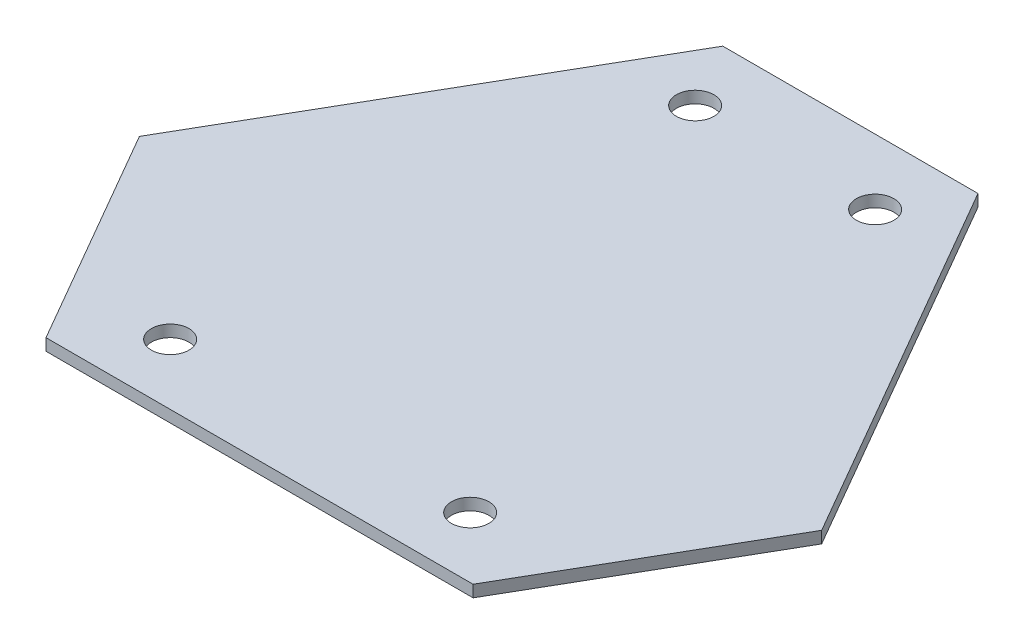
ISO-10303-21;
HEADER;
FILE_DESCRIPTION(('STEP AP214'),'2;1');
FILE_NAME('part.step','',(''),(''),'','','');
FILE_SCHEMA(('AUTOMOTIVE_DESIGN { 1 0 10303 214 1 1 1 1 }'));
ENDSEC;
DATA;
#1=APPLICATION_CONTEXT('core data for automotive mechanical design processes');
#2=APPLICATION_PROTOCOL_DEFINITION('international standard','automotive_design',2000,#1);
#3=PRODUCT_CONTEXT('',#1,'mechanical');
#4=PRODUCT('Part','Part','',(#3));
#5=PRODUCT_RELATED_PRODUCT_CATEGORY('part','',(#4));
#6=PRODUCT_DEFINITION_FORMATION('','',#4);
#7=PRODUCT_DEFINITION_CONTEXT('part definition',#1,'design');
#8=PRODUCT_DEFINITION('design','',#6,#7);
#9=PRODUCT_DEFINITION_SHAPE('','',#8);
#10=(LENGTH_UNIT() NAMED_UNIT(*) SI_UNIT(.MILLI.,.METRE.));
#11=(NAMED_UNIT(*) PLANE_ANGLE_UNIT() SI_UNIT($,.RADIAN.));
#12=(NAMED_UNIT(*) SI_UNIT($,.STERADIAN.) SOLID_ANGLE_UNIT());
#13=UNCERTAINTY_MEASURE_WITH_UNIT(LENGTH_MEASURE(1.E-05),#10,'distance_accuracy_value','');
#14=(GEOMETRIC_REPRESENTATION_CONTEXT(3) GLOBAL_UNCERTAINTY_ASSIGNED_CONTEXT((#13)) GLOBAL_UNIT_ASSIGNED_CONTEXT((#10,
#11,#12)) REPRESENTATION_CONTEXT('',''));
#15=CARTESIAN_POINT('',(0.,0.,0.));
#16=DIRECTION('',(0.,0.,1.));
#17=DIRECTION('',(1.,0.,0.));
#18=AXIS2_PLACEMENT_3D('',#15,#16,#17);
#19=CARTESIAN_POINT('',(0.,0.,0.));
#20=DIRECTION('',(0.,1.,0.));
#21=DIRECTION('',(0.,0.,1.));
#22=AXIS2_PLACEMENT_3D('',#19,#20,#21);
#23=PLANE('',#22);
#24=DIRECTION('',(0.500000000000002,0.,0.866025403784437));
#25=VECTOR('',#24,1.);
#26=CARTESIAN_POINT('',(15.875,0.,-9.16543552338539));
#27=LINE('',#26,#25);
#28=CARTESIAN_POINT('',(8.64301556751302,0.,-21.6916));
#29=VERTEX_POINT('',#28);
#30=CARTESIAN_POINT('',(23.1069844324869,0.,3.36072895322899));
#31=VERTEX_POINT('',#30);
#32=EDGE_CURVE('E163',#29,#31,#27,.T.);
#33=ORIENTED_EDGE('',*,*,#32,.T.);
#34=DIRECTION('',(-0.5,0.,0.866025403784439));
#35=VECTOR('',#34,1.);
#36=CARTESIAN_POINT('',(18.7854766487303,0.,10.8457999999999));
#37=LINE('',#36,#35);
#38=CARTESIAN_POINT('',(14.4639688649739,0.,18.3308710467703));
#39=VERTEX_POINT('',#38);
#40=EDGE_CURVE('E161',#31,#39,#37,.T.);
#41=ORIENTED_EDGE('',*,*,#40,.T.);
#42=DIRECTION('',(-1.,0.,0.));
#43=VECTOR('',#42,1.);
#44=CARTESIAN_POINT('',(0.,0.,18.3308710467703));
#45=LINE('',#44,#43);
#46=CARTESIAN_POINT('',(-14.4639688649738,0.,18.3308710467704));
#47=VERTEX_POINT('',#46);
#48=EDGE_CURVE('E99',#39,#47,#45,.T.);
#49=ORIENTED_EDGE('',*,*,#48,.T.);
#50=DIRECTION('',(-0.499999999999995,0.,-0.866025403784442));
#51=VECTOR('',#50,1.);
#52=CARTESIAN_POINT('',(-18.7854766487302,0.,10.8457999999997));
#53=LINE('',#52,#51);
#54=CARTESIAN_POINT('',(-23.1069844324867,0.,3.36072895322896));
#55=VERTEX_POINT('',#54);
#56=EDGE_CURVE('E169',#47,#55,#53,.T.);
#57=ORIENTED_EDGE('',*,*,#56,.T.);
#58=DIRECTION('',(0.499999999999998,0.,-0.86602540378444));
#59=VECTOR('',#58,1.);
#60=CARTESIAN_POINT('',(-15.875,0.,-9.16543552338526));
#61=LINE('',#60,#59);
#62=CARTESIAN_POINT('',(-8.64301556751303,0.,-21.6916));
#63=VERTEX_POINT('',#62);
#64=EDGE_CURVE('E125',#55,#63,#61,.T.);
#65=ORIENTED_EDGE('',*,*,#64,.T.);
#66=DIRECTION('',(1.,0.,0.));
#67=VECTOR('',#66,1.);
#68=CARTESIAN_POINT('',(0.,0.,-21.6916));
#69=LINE('',#68,#67);
#70=EDGE_CURVE('E165',#63,#29,#69,.T.);
#71=ORIENTED_EDGE('',*,*,#70,.T.);
#72=EDGE_LOOP('',(#33,#41,#49,#57,#65,#71));
#73=FACE_BOUND('',#72,.T.);
#74=CARTESIAN_POINT('',(6.096,0.,-17.272));
#75=DIRECTION('',(0.,1.,0.));
#76=DIRECTION('',(0.,0.,1.));
#77=AXIS2_PLACEMENT_3D('',#74,#75,#76);
#78=CIRCLE('',#77,1.27);
#79=CARTESIAN_POINT('',(6.096,0.,-16.002));
#80=VERTEX_POINT('',#79);
#81=EDGE_CURVE('E181',#80,#80,#78,.F.);
#82=ORIENTED_EDGE('',*,*,#81,.F.);
#83=EDGE_LOOP('',(#82));
#84=FACE_BOUND('',#83,.T.);
#85=CARTESIAN_POINT('',(-6.096,0.,-17.272));
#86=DIRECTION('',(0.,1.,0.));
#87=DIRECTION('',(0.,0.,1.));
#88=AXIS2_PLACEMENT_3D('',#85,#86,#87);
#89=CIRCLE('',#88,1.27);
#90=CARTESIAN_POINT('',(-6.096,0.,-16.002));
#91=VERTEX_POINT('',#90);
#92=EDGE_CURVE('E178',#91,#91,#89,.T.);
#93=ORIENTED_EDGE('',*,*,#92,.T.);
#94=EDGE_LOOP('',(#93));
#95=FACE_BOUND('',#94,.T.);
#96=CARTESIAN_POINT('',(-10.16,0.,14.224));
#97=DIRECTION('',(0.,1.,0.));
#98=DIRECTION('',(0.,0.,1.));
#99=AXIS2_PLACEMENT_3D('',#96,#97,#98);
#100=CIRCLE('',#99,1.27);
#101=CARTESIAN_POINT('',(-10.16,0.,15.494));
#102=VERTEX_POINT('',#101);
#103=EDGE_CURVE('E172',#102,#102,#100,.T.);
#104=ORIENTED_EDGE('',*,*,#103,.T.);
#105=EDGE_LOOP('',(#104));
#106=FACE_BOUND('',#105,.T.);
#107=CARTESIAN_POINT('',(10.16,0.,14.224));
#108=DIRECTION('',(0.,1.,0.));
#109=DIRECTION('',(0.,0.,1.));
#110=AXIS2_PLACEMENT_3D('',#107,#108,#109);
#111=CIRCLE('',#110,1.27);
#112=CARTESIAN_POINT('',(10.16,0.,15.494));
#113=VERTEX_POINT('',#112);
#114=EDGE_CURVE('E175',#113,#113,#111,.F.);
#115=ORIENTED_EDGE('',*,*,#114,.F.);
#116=EDGE_LOOP('',(#115));
#117=FACE_BOUND('',#116,.T.);
#118=ADVANCED_FACE('F60',(#73,#84,#95,#106,#117),#23,.F.);
#119=CARTESIAN_POINT('',(0.,0.8,0.));
#120=DIRECTION('',(0.,1.,0.));
#121=DIRECTION('',(0.,0.,1.));
#122=AXIS2_PLACEMENT_3D('',#119,#120,#121);
#123=PLANE('',#122);
#124=DIRECTION('',(-0.499999999999995,0.,-0.866025403784442));
#125=VECTOR('',#124,1.);
#126=CARTESIAN_POINT('',(-18.7854766487302,0.8,10.8457999999997));
#127=LINE('',#126,#125);
#128=CARTESIAN_POINT('',(-14.4639688649738,0.8,18.3308710467704));
#129=VERTEX_POINT('',#128);
#130=CARTESIAN_POINT('',(-23.1069844324867,0.8,3.36072895322896));
#131=VERTEX_POINT('',#130);
#132=EDGE_CURVE('E138',#129,#131,#127,.T.);
#133=ORIENTED_EDGE('',*,*,#132,.F.);
#134=DIRECTION('',(-1.,0.,0.));
#135=VECTOR('',#134,1.);
#136=CARTESIAN_POINT('',(0.,0.8,18.3308710467703));
#137=LINE('',#136,#135);
#138=CARTESIAN_POINT('',(14.4639688649739,0.8,18.3308710467703));
#139=VERTEX_POINT('',#138);
#140=EDGE_CURVE('E144',#139,#129,#137,.T.);
#141=ORIENTED_EDGE('',*,*,#140,.F.);
#142=DIRECTION('',(-0.5,0.,0.866025403784439));
#143=VECTOR('',#142,1.);
#144=CARTESIAN_POINT('',(18.7854766487303,0.8,10.8457999999999));
#145=LINE('',#144,#143);
#146=CARTESIAN_POINT('',(23.1069844324869,0.8,3.36072895322899));
#147=VERTEX_POINT('',#146);
#148=EDGE_CURVE('E184',#147,#139,#145,.T.);
#149=ORIENTED_EDGE('',*,*,#148,.F.);
#150=DIRECTION('',(0.500000000000002,0.,0.866025403784437));
#151=VECTOR('',#150,1.);
#152=CARTESIAN_POINT('',(15.875,0.8,-9.16543552338539));
#153=LINE('',#152,#151);
#154=CARTESIAN_POINT('',(8.64301556751302,0.8,-21.6916));
#155=VERTEX_POINT('',#154);
#156=EDGE_CURVE('E110',#155,#147,#153,.T.);
#157=ORIENTED_EDGE('',*,*,#156,.F.);
#158=DIRECTION('',(1.,0.,0.));
#159=VECTOR('',#158,1.);
#160=CARTESIAN_POINT('',(0.,0.8,-21.6916));
#161=LINE('',#160,#159);
#162=CARTESIAN_POINT('',(-8.64301556751303,0.8,-21.6916));
#163=VERTEX_POINT('',#162);
#164=EDGE_CURVE('E140',#163,#155,#161,.T.);
#165=ORIENTED_EDGE('',*,*,#164,.F.);
#166=DIRECTION('',(0.499999999999998,0.,-0.86602540378444));
#167=VECTOR('',#166,1.);
#168=CARTESIAN_POINT('',(-15.875,0.8,-9.16543552338526));
#169=LINE('',#168,#167);
#170=EDGE_CURVE('E123',#131,#163,#169,.T.);
#171=ORIENTED_EDGE('',*,*,#170,.F.);
#172=EDGE_LOOP('',(#133,#141,#149,#157,#165,#171));
#173=FACE_BOUND('',#172,.T.);
#174=CARTESIAN_POINT('',(6.096,0.8,-17.272));
#175=DIRECTION('',(0.,1.,0.));
#176=DIRECTION('',(0.,0.,1.));
#177=AXIS2_PLACEMENT_3D('',#174,#175,#176);
#178=CIRCLE('',#177,1.27);
#179=CARTESIAN_POINT('',(6.096,0.8,-16.002));
#180=VERTEX_POINT('',#179);
#181=EDGE_CURVE('E158',#180,#180,#178,.F.);
#182=ORIENTED_EDGE('',*,*,#181,.T.);
#183=EDGE_LOOP('',(#182));
#184=FACE_BOUND('',#183,.T.);
#185=CARTESIAN_POINT('',(-6.096,0.8,-17.272));
#186=DIRECTION('',(0.,1.,0.));
#187=DIRECTION('',(0.,0.,1.));
#188=AXIS2_PLACEMENT_3D('',#185,#186,#187);
#189=CIRCLE('',#188,1.27);
#190=CARTESIAN_POINT('',(-6.096,0.8,-16.002));
#191=VERTEX_POINT('',#190);
#192=EDGE_CURVE('E155',#191,#191,#189,.T.);
#193=ORIENTED_EDGE('',*,*,#192,.F.);
#194=EDGE_LOOP('',(#193));
#195=FACE_BOUND('',#194,.T.);
#196=CARTESIAN_POINT('',(-10.16,0.8,14.224));
#197=DIRECTION('',(0.,1.,0.));
#198=DIRECTION('',(0.,0.,1.));
#199=AXIS2_PLACEMENT_3D('',#196,#197,#198);
#200=CIRCLE('',#199,1.27);
#201=CARTESIAN_POINT('',(-10.16,0.8,15.494));
#202=VERTEX_POINT('',#201);
#203=EDGE_CURVE('E146',#202,#202,#200,.T.);
#204=ORIENTED_EDGE('',*,*,#203,.F.);
#205=EDGE_LOOP('',(#204));
#206=FACE_BOUND('',#205,.T.);
#207=CARTESIAN_POINT('',(10.16,0.8,14.224));
#208=DIRECTION('',(0.,1.,0.));
#209=DIRECTION('',(0.,0.,1.));
#210=AXIS2_PLACEMENT_3D('',#207,#208,#209);
#211=CIRCLE('',#210,1.27);
#212=CARTESIAN_POINT('',(10.16,0.8,15.494));
#213=VERTEX_POINT('',#212);
#214=EDGE_CURVE('E152',#213,#213,#211,.F.);
#215=ORIENTED_EDGE('',*,*,#214,.T.);
#216=EDGE_LOOP('',(#215));
#217=FACE_BOUND('',#216,.T.);
#218=ADVANCED_FACE('F135',(#173,#184,#195,#206,#217),#123,.T.);
#219=CARTESIAN_POINT('',(18.7854766487303,0.8,10.8457999999999));
#220=DIRECTION('',(0.866025403784439,0.,0.5));
#221=DIRECTION('',(0.5,0.,-0.866025403784439));
#222=AXIS2_PLACEMENT_3D('',#219,#220,#221);
#223=PLANE('',#222);
#224=ORIENTED_EDGE('',*,*,#40,.F.);
#225=DIRECTION('',(0.,-1.,0.));
#226=VECTOR('',#225,1.);
#227=CARTESIAN_POINT('',(23.1069844324869,0.8,3.36072895322899));
#228=LINE('',#227,#226);
#229=EDGE_CURVE('E12',#147,#31,#228,.T.);
#230=ORIENTED_EDGE('',*,*,#229,.F.);
#231=ORIENTED_EDGE('',*,*,#148,.T.);
#232=DIRECTION('',(0.,-1.,0.));
#233=VECTOR('',#232,1.);
#234=CARTESIAN_POINT('',(14.4639688649739,0.8,18.3308710467703));
#235=LINE('',#234,#233);
#236=EDGE_CURVE('E77',#139,#39,#235,.T.);
#237=ORIENTED_EDGE('',*,*,#236,.T.);
#238=EDGE_LOOP('',(#224,#230,#231,#237));
#239=FACE_BOUND('',#238,.T.);
#240=ADVANCED_FACE('F62',(#239),#223,.T.);
#241=CARTESIAN_POINT('',(10.16,0.8,14.224));
#242=DIRECTION('',(0.,-1.,0.));
#243=DIRECTION('',(0.,0.,-1.));
#244=AXIS2_PLACEMENT_3D('',#241,#242,#243);
#245=CYLINDRICAL_SURFACE('',#244,1.27);
#246=ORIENTED_EDGE('',*,*,#214,.F.);
#247=EDGE_LOOP('',(#246));
#248=FACE_BOUND('',#247,.T.);
#249=ORIENTED_EDGE('',*,*,#114,.T.);
#250=EDGE_LOOP('',(#249));
#251=FACE_BOUND('',#250,.T.);
#252=ADVANCED_FACE('F203',(#248,#251),#245,.F.);
#253=CARTESIAN_POINT('',(-18.7854766487302,0.8,10.8457999999997));
#254=DIRECTION('',(-0.866025403784441,0.,0.499999999999995));
#255=DIRECTION('',(0.499999999999995,0.,0.866025403784441));
#256=AXIS2_PLACEMENT_3D('',#253,#254,#255);
#257=PLANE('',#256);
#258=ORIENTED_EDGE('',*,*,#56,.F.);
#259=DIRECTION('',(0.,-1.,0.));
#260=VECTOR('',#259,1.);
#261=CARTESIAN_POINT('',(-14.4639688649738,0.8,18.3308710467704));
#262=LINE('',#261,#260);
#263=EDGE_CURVE('E130',#129,#47,#262,.T.);
#264=ORIENTED_EDGE('',*,*,#263,.F.);
#265=ORIENTED_EDGE('',*,*,#132,.T.);
#266=DIRECTION('',(0.,-1.,0.));
#267=VECTOR('',#266,1.);
#268=CARTESIAN_POINT('',(-23.1069844324867,0.8,3.36072895322896));
#269=LINE('',#268,#267);
#270=EDGE_CURVE('E119',#131,#55,#269,.T.);
#271=ORIENTED_EDGE('',*,*,#270,.T.);
#272=EDGE_LOOP('',(#258,#264,#265,#271));
#273=FACE_BOUND('',#272,.T.);
#274=ADVANCED_FACE('F143',(#273),#257,.T.);
#275=CARTESIAN_POINT('',(0.,0.8,18.3308710467703));
#276=DIRECTION('',(0.,0.,1.));
#277=DIRECTION('',(1.,0.,0.));
#278=AXIS2_PLACEMENT_3D('',#275,#276,#277);
#279=PLANE('',#278);
#280=ORIENTED_EDGE('',*,*,#263,.T.);
#281=ORIENTED_EDGE('',*,*,#48,.F.);
#282=ORIENTED_EDGE('',*,*,#236,.F.);
#283=ORIENTED_EDGE('',*,*,#140,.T.);
#284=EDGE_LOOP('',(#280,#281,#282,#283));
#285=FACE_BOUND('',#284,.T.);
#286=ADVANCED_FACE('F211',(#285),#279,.T.);
#287=CARTESIAN_POINT('',(-10.16,0.8,14.224));
#288=DIRECTION('',(0.,-1.,0.));
#289=DIRECTION('',(0.,0.,-1.));
#290=AXIS2_PLACEMENT_3D('',#287,#288,#289);
#291=CYLINDRICAL_SURFACE('',#290,1.27);
#292=ORIENTED_EDGE('',*,*,#203,.T.);
#293=EDGE_LOOP('',(#292));
#294=FACE_BOUND('',#293,.T.);
#295=ORIENTED_EDGE('',*,*,#103,.F.);
#296=EDGE_LOOP('',(#295));
#297=FACE_BOUND('',#296,.T.);
#298=ADVANCED_FACE('F218',(#294,#297),#291,.F.);
#299=CARTESIAN_POINT('',(15.875,0.8,-9.16543552338539));
#300=DIRECTION('',(0.866025403784437,0.,-0.500000000000002));
#301=DIRECTION('',(-0.500000000000002,0.,-0.866025403784437));
#302=AXIS2_PLACEMENT_3D('',#299,#300,#301);
#303=PLANE('',#302);
#304=ORIENTED_EDGE('',*,*,#156,.T.);
#305=ORIENTED_EDGE('',*,*,#229,.T.);
#306=ORIENTED_EDGE('',*,*,#32,.F.);
#307=DIRECTION('',(0.,-1.,0.));
#308=VECTOR('',#307,1.);
#309=CARTESIAN_POINT('',(8.64301556751302,0.8,-21.6916));
#310=LINE('',#309,#308);
#311=EDGE_CURVE('E69',#155,#29,#310,.T.);
#312=ORIENTED_EDGE('',*,*,#311,.F.);
#313=EDGE_LOOP('',(#304,#305,#306,#312));
#314=FACE_BOUND('',#313,.T.);
#315=ADVANCED_FACE('F191',(#314),#303,.T.);
#316=CARTESIAN_POINT('',(0.,0.8,-21.6916));
#317=DIRECTION('',(0.,0.,-1.));
#318=DIRECTION('',(-1.,0.,0.));
#319=AXIS2_PLACEMENT_3D('',#316,#317,#318);
#320=PLANE('',#319);
#321=ORIENTED_EDGE('',*,*,#70,.F.);
#322=DIRECTION('',(0.,-1.,0.));
#323=VECTOR('',#322,1.);
#324=CARTESIAN_POINT('',(-8.64301556751303,0.8,-21.6916));
#325=LINE('',#324,#323);
#326=EDGE_CURVE('E129',#163,#63,#325,.T.);
#327=ORIENTED_EDGE('',*,*,#326,.F.);
#328=ORIENTED_EDGE('',*,*,#164,.T.);
#329=ORIENTED_EDGE('',*,*,#311,.T.);
#330=EDGE_LOOP('',(#321,#327,#328,#329));
#331=FACE_BOUND('',#330,.T.);
#332=ADVANCED_FACE('F190',(#331),#320,.T.);
#333=CARTESIAN_POINT('',(-15.875,0.8,-9.16543552338526));
#334=DIRECTION('',(-0.86602540378444,0.,-0.499999999999998));
#335=DIRECTION('',(-0.499999999999998,0.,0.86602540378444));
#336=AXIS2_PLACEMENT_3D('',#333,#334,#335);
#337=PLANE('',#336);
#338=ORIENTED_EDGE('',*,*,#326,.T.);
#339=ORIENTED_EDGE('',*,*,#64,.F.);
#340=ORIENTED_EDGE('',*,*,#270,.F.);
#341=ORIENTED_EDGE('',*,*,#170,.T.);
#342=EDGE_LOOP('',(#338,#339,#340,#341));
#343=FACE_BOUND('',#342,.T.);
#344=ADVANCED_FACE('F122',(#343),#337,.T.);
#345=CARTESIAN_POINT('',(-6.096,0.8,-17.272));
#346=DIRECTION('',(0.,-1.,0.));
#347=DIRECTION('',(0.,0.,-1.));
#348=AXIS2_PLACEMENT_3D('',#345,#346,#347);
#349=CYLINDRICAL_SURFACE('',#348,1.27);
#350=ORIENTED_EDGE('',*,*,#192,.T.);
#351=EDGE_LOOP('',(#350));
#352=FACE_BOUND('',#351,.T.);
#353=ORIENTED_EDGE('',*,*,#92,.F.);
#354=EDGE_LOOP('',(#353));
#355=FACE_BOUND('',#354,.T.);
#356=ADVANCED_FACE('F216',(#352,#355),#349,.F.);
#357=CARTESIAN_POINT('',(6.096,0.8,-17.272));
#358=DIRECTION('',(0.,-1.,0.));
#359=DIRECTION('',(0.,0.,-1.));
#360=AXIS2_PLACEMENT_3D('',#357,#358,#359);
#361=CYLINDRICAL_SURFACE('',#360,1.27);
#362=ORIENTED_EDGE('',*,*,#181,.F.);
#363=EDGE_LOOP('',(#362));
#364=FACE_BOUND('',#363,.T.);
#365=ORIENTED_EDGE('',*,*,#81,.T.);
#366=EDGE_LOOP('',(#365));
#367=FACE_BOUND('',#366,.T.);
#368=ADVANCED_FACE('F246',(#364,#367),#361,.F.);
#369=CLOSED_SHELL('',(#118,#218,#240,#252,#274,#286,#298,#315,#332,#344,#356,#368));
#370=MANIFOLD_SOLID_BREP('B2',#369);
#371=ADVANCED_BREP_SHAPE_REPRESENTATION('',(#18,#370),#14);
#372=SHAPE_DEFINITION_REPRESENTATION(#9,#371);
ENDSEC;
END-ISO-10303-21;
